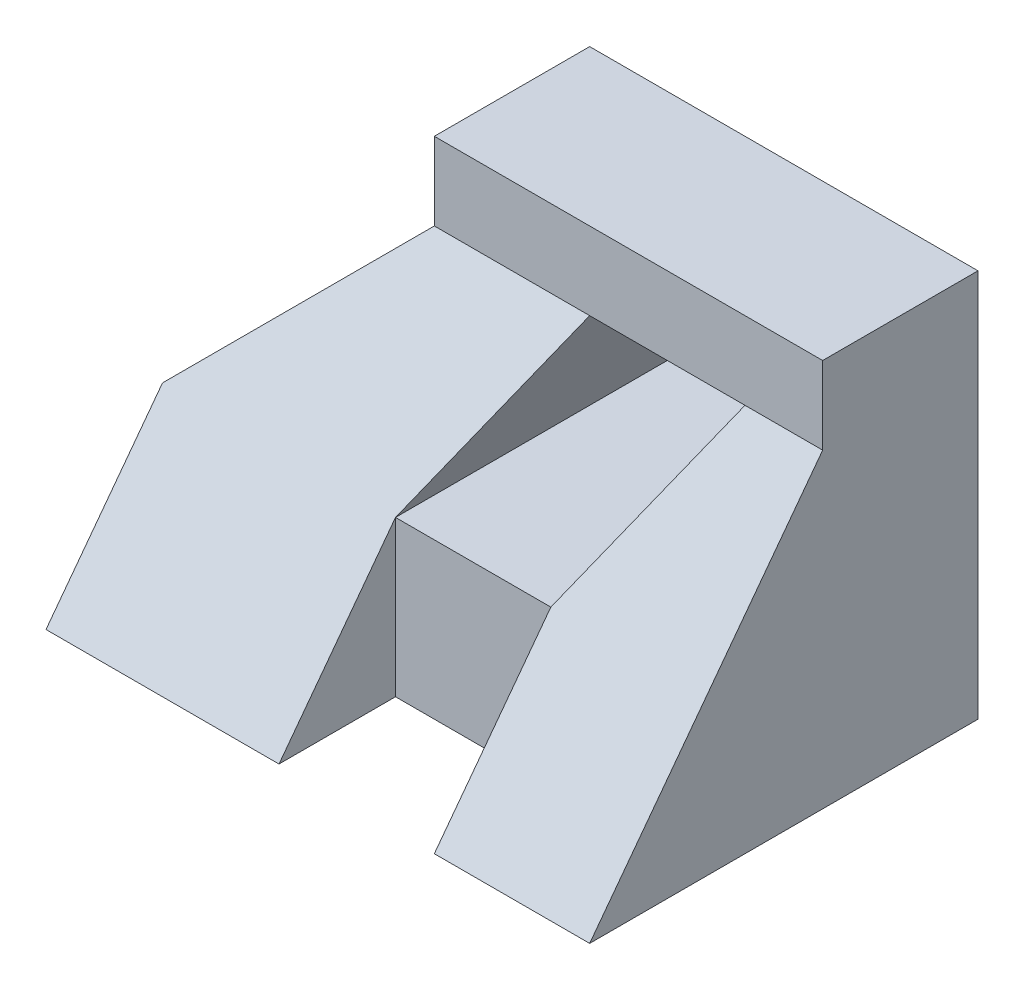
ISO-10303-21;
HEADER;
FILE_DESCRIPTION(('STEP AP214'),'2;1');
FILE_NAME('part.step','',(''),(''),'','','');
FILE_SCHEMA(('AUTOMOTIVE_DESIGN { 1 0 10303 214 1 1 1 1 }'));
ENDSEC;
DATA;
#1=APPLICATION_CONTEXT('core data for automotive mechanical design processes');
#2=APPLICATION_PROTOCOL_DEFINITION('international standard','automotive_design',2000,#1);
#3=PRODUCT_CONTEXT('',#1,'mechanical');
#4=PRODUCT('Part','Part','',(#3));
#5=PRODUCT_RELATED_PRODUCT_CATEGORY('part','',(#4));
#6=PRODUCT_DEFINITION_FORMATION('','',#4);
#7=PRODUCT_DEFINITION_CONTEXT('part definition',#1,'design');
#8=PRODUCT_DEFINITION('design','',#6,#7);
#9=PRODUCT_DEFINITION_SHAPE('','',#8);
#10=(LENGTH_UNIT() NAMED_UNIT(*) SI_UNIT(.MILLI.,.METRE.));
#11=(NAMED_UNIT(*) PLANE_ANGLE_UNIT() SI_UNIT($,.RADIAN.));
#12=(NAMED_UNIT(*) SI_UNIT($,.STERADIAN.) SOLID_ANGLE_UNIT());
#13=UNCERTAINTY_MEASURE_WITH_UNIT(LENGTH_MEASURE(1.E-05),#10,'distance_accuracy_value','');
#14=(GEOMETRIC_REPRESENTATION_CONTEXT(3) GLOBAL_UNCERTAINTY_ASSIGNED_CONTEXT((#13)) GLOBAL_UNIT_ASSIGNED_CONTEXT((#10,
#11,#12)) REPRESENTATION_CONTEXT('',''));
#15=CARTESIAN_POINT('',(0.,0.,0.));
#16=DIRECTION('',(0.,0.,1.));
#17=DIRECTION('',(1.,0.,0.));
#18=AXIS2_PLACEMENT_3D('',#15,#16,#17);
#19=CARTESIAN_POINT('',(70.,40.,50.));
#20=DIRECTION('',(-1.,0.,0.));
#21=DIRECTION('',(0.,-1.,0.));
#22=AXIS2_PLACEMENT_3D('',#19,#20,#21);
#23=PLANE('',#22);
#24=DIRECTION('',(0.,0.8,-0.6));
#25=VECTOR('',#24,1.);
#26=CARTESIAN_POINT('',(70.,24.,32.));
#27=LINE('',#26,#25);
#28=CARTESIAN_POINT('',(70.,0.,50.));
#29=VERTEX_POINT('',#28);
#30=CARTESIAN_POINT('',(70.,40.,20.));
#31=VERTEX_POINT('',#30);
#32=EDGE_CURVE('E130',#29,#31,#27,.T.);
#33=ORIENTED_EDGE('',*,*,#32,.F.);
#34=DIRECTION('',(0.,0.,-1.));
#35=VECTOR('',#34,1.);
#36=CARTESIAN_POINT('',(70.,-5.66581972714029E-13,50.));
#37=LINE('',#36,#35);
#38=CARTESIAN_POINT('',(70.,-5.66581972714029E-13,0.));
#39=VERTEX_POINT('',#38);
#40=EDGE_CURVE('E11',#29,#39,#37,.T.);
#41=ORIENTED_EDGE('',*,*,#40,.T.);
#42=DIRECTION('',(0.,1.,0.));
#43=VECTOR('',#42,1.);
#44=CARTESIAN_POINT('',(70.,40.,0.));
#45=LINE('',#44,#43);
#46=CARTESIAN_POINT('',(70.,50.,0.));
#47=VERTEX_POINT('',#46);
#48=EDGE_CURVE('E154',#39,#47,#45,.T.);
#49=ORIENTED_EDGE('',*,*,#48,.T.);
#50=DIRECTION('',(0.,0.,1.));
#51=VECTOR('',#50,1.);
#52=CARTESIAN_POINT('',(70.,50.,0.));
#53=LINE('',#52,#51);
#54=CARTESIAN_POINT('',(70.,50.,20.));
#55=VERTEX_POINT('',#54);
#56=EDGE_CURVE('E187',#47,#55,#53,.T.);
#57=ORIENTED_EDGE('',*,*,#56,.T.);
#58=DIRECTION('',(0.,1.,0.));
#59=VECTOR('',#58,1.);
#60=CARTESIAN_POINT('',(70.,50.,20.));
#61=LINE('',#60,#59);
#62=EDGE_CURVE('E142',#31,#55,#61,.T.);
#63=ORIENTED_EDGE('',*,*,#62,.F.);
#64=EDGE_LOOP('',(#33,#41,#49,#57,#63));
#65=FACE_BOUND('',#64,.T.);
#66=ADVANCED_FACE('F33',(#65),#23,.F.);
#67=CARTESIAN_POINT('',(0.,20.,50.));
#68=DIRECTION('',(0.707106781186548,-0.707106781186547,0.));
#69=DIRECTION('',(0.707106781186547,0.707106781186548,0.));
#70=AXIS2_PLACEMENT_3D('',#67,#68,#69);
#71=PLANE('',#70);
#72=DIRECTION('',(-0.624695047554424,-0.624695047554424,0.468521285665818));
#73=VECTOR('',#72,1.);
#74=CARTESIAN_POINT('',(-4.39024390243902,15.609756097561,38.2926829268293));
#75=LINE('',#74,#73);
#76=CARTESIAN_POINT('',(20.,40.,20.));
#77=VERTEX_POINT('',#76);
#78=CARTESIAN_POINT('',(0.,20.,35.));
#79=VERTEX_POINT('',#78);
#80=EDGE_CURVE('E174',#77,#79,#75,.T.);
#81=ORIENTED_EDGE('',*,*,#80,.F.);
#82=DIRECTION('',(0.,0.,-1.));
#83=VECTOR('',#82,1.);
#84=CARTESIAN_POINT('',(20.,40.,50.));
#85=LINE('',#84,#83);
#86=CARTESIAN_POINT('',(20.,40.,0.));
#87=VERTEX_POINT('',#86);
#88=EDGE_CURVE('E41',#77,#87,#85,.T.);
#89=ORIENTED_EDGE('',*,*,#88,.T.);
#90=DIRECTION('',(-0.707106781186547,-0.707106781186548,0.));
#91=VECTOR('',#90,1.);
#92=CARTESIAN_POINT('',(0.,20.,0.));
#93=LINE('',#92,#91);
#94=CARTESIAN_POINT('',(0.,20.,0.));
#95=VERTEX_POINT('',#94);
#96=EDGE_CURVE('E157',#87,#95,#93,.T.);
#97=ORIENTED_EDGE('',*,*,#96,.T.);
#98=DIRECTION('',(0.,0.,-1.));
#99=VECTOR('',#98,1.);
#100=CARTESIAN_POINT('',(0.,20.,50.));
#101=LINE('',#100,#99);
#102=EDGE_CURVE('E167',#79,#95,#101,.T.);
#103=ORIENTED_EDGE('',*,*,#102,.F.);
#104=EDGE_LOOP('',(#81,#89,#97,#103));
#105=FACE_BOUND('',#104,.T.);
#106=ADVANCED_FACE('F172',(#105),#71,.F.);
#107=CARTESIAN_POINT('',(0.,0.,50.));
#108=DIRECTION('',(1.,0.,0.));
#109=DIRECTION('',(0.,0.,-1.));
#110=AXIS2_PLACEMENT_3D('',#107,#108,#109);
#111=PLANE('',#110);
#112=DIRECTION('',(0.,0.8,-0.6));
#113=VECTOR('',#112,1.);
#114=CARTESIAN_POINT('',(0.,24.,32.));
#115=LINE('',#114,#113);
#116=CARTESIAN_POINT('',(0.,0.,50.));
#117=VERTEX_POINT('',#116);
#118=EDGE_CURVE('E144',#117,#79,#115,.T.);
#119=ORIENTED_EDGE('',*,*,#118,.T.);
#120=ORIENTED_EDGE('',*,*,#102,.T.);
#121=DIRECTION('',(0.,-1.,0.));
#122=VECTOR('',#121,1.);
#123=CARTESIAN_POINT('',(0.,0.,0.));
#124=LINE('',#123,#122);
#125=CARTESIAN_POINT('',(0.,0.,0.));
#126=VERTEX_POINT('',#125);
#127=EDGE_CURVE('E136',#95,#126,#124,.T.);
#128=ORIENTED_EDGE('',*,*,#127,.T.);
#129=DIRECTION('',(0.,0.,-1.));
#130=VECTOR('',#129,1.);
#131=CARTESIAN_POINT('',(0.,0.,50.));
#132=LINE('',#131,#130);
#133=EDGE_CURVE('E151',#117,#126,#132,.T.);
#134=ORIENTED_EDGE('',*,*,#133,.F.);
#135=EDGE_LOOP('',(#119,#120,#128,#134));
#136=FACE_BOUND('',#135,.T.);
#137=ADVANCED_FACE('F268',(#136),#111,.F.);
#138=CARTESIAN_POINT('',(50.,0.,30.));
#139=DIRECTION('',(1.,0.,0.));
#140=DIRECTION('',(0.,0.,-1.));
#141=AXIS2_PLACEMENT_3D('',#138,#139,#140);
#142=PLANE('',#141);
#143=DIRECTION('',(0.,-0.8,0.6));
#144=VECTOR('',#143,1.);
#145=CARTESIAN_POINT('',(50.,9.6,42.8));
#146=LINE('',#145,#144);
#147=CARTESIAN_POINT('',(50.,20.,35.));
#148=VERTEX_POINT('',#147);
#149=CARTESIAN_POINT('',(50.,0.,50.));
#150=VERTEX_POINT('',#149);
#151=EDGE_CURVE('E132',#148,#150,#146,.T.);
#152=ORIENTED_EDGE('',*,*,#151,.F.);
#153=DIRECTION('',(0.,1.,0.));
#154=VECTOR('',#153,1.);
#155=CARTESIAN_POINT('',(50.,20.,35.));
#156=LINE('',#155,#154);
#157=CARTESIAN_POINT('',(50.,0.,35.));
#158=VERTEX_POINT('',#157);
#159=EDGE_CURVE('E56',#158,#148,#156,.T.);
#160=ORIENTED_EDGE('',*,*,#159,.F.);
#161=DIRECTION('',(0.,0.,1.));
#162=VECTOR('',#161,1.);
#163=CARTESIAN_POINT('',(50.,0.,30.));
#164=LINE('',#163,#162);
#165=EDGE_CURVE('E155',#158,#150,#164,.T.);
#166=ORIENTED_EDGE('',*,*,#165,.T.);
#167=EDGE_LOOP('',(#152,#160,#166));
#168=FACE_BOUND('',#167,.T.);
#169=ADVANCED_FACE('F273',(#168),#142,.F.);
#170=CARTESIAN_POINT('',(30.,0.,30.));
#171=DIRECTION('',(-1.,0.,0.));
#172=DIRECTION('',(0.,0.,1.));
#173=AXIS2_PLACEMENT_3D('',#170,#171,#172);
#174=PLANE('',#173);
#175=DIRECTION('',(0.,0.8,-0.6));
#176=VECTOR('',#175,1.);
#177=CARTESIAN_POINT('',(30.,9.6,42.8));
#178=LINE('',#177,#176);
#179=CARTESIAN_POINT('',(30.,0.,50.));
#180=VERTEX_POINT('',#179);
#181=CARTESIAN_POINT('',(30.,20.,35.));
#182=VERTEX_POINT('',#181);
#183=EDGE_CURVE('E206',#180,#182,#178,.T.);
#184=ORIENTED_EDGE('',*,*,#183,.F.);
#185=DIRECTION('',(0.,0.,1.));
#186=VECTOR('',#185,1.);
#187=CARTESIAN_POINT('',(30.,0.,30.));
#188=LINE('',#187,#186);
#189=CARTESIAN_POINT('',(30.,0.,35.));
#190=VERTEX_POINT('',#189);
#191=EDGE_CURVE('E159',#190,#180,#188,.T.);
#192=ORIENTED_EDGE('',*,*,#191,.F.);
#193=DIRECTION('',(0.,-1.,0.));
#194=VECTOR('',#193,1.);
#195=CARTESIAN_POINT('',(30.,20.,35.));
#196=LINE('',#195,#194);
#197=EDGE_CURVE('E204',#182,#190,#196,.T.);
#198=ORIENTED_EDGE('',*,*,#197,.F.);
#199=EDGE_LOOP('',(#184,#192,#198));
#200=FACE_BOUND('',#199,.T.);
#201=ADVANCED_FACE('F203',(#200),#174,.F.);
#202=CARTESIAN_POINT('',(30.,20.,40.));
#203=DIRECTION('',(-0.894427190999916,0.447213595499959,0.));
#204=DIRECTION('',(-0.447213595499959,-0.894427190999916,0.));
#205=AXIS2_PLACEMENT_3D('',#202,#203,#204);
#206=PLANE('',#205);
#207=DIRECTION('',(0.371390676354104,0.742781352708207,-0.557086014531155));
#208=VECTOR('',#207,1.);
#209=CARTESIAN_POINT('',(28.9655172413793,17.9310344827586,36.551724137931));
#210=LINE('',#209,#208);
#211=CARTESIAN_POINT('',(40.,40.,20.));
#212=VERTEX_POINT('',#211);
#213=EDGE_CURVE('E209',#182,#212,#210,.T.);
#214=ORIENTED_EDGE('',*,*,#213,.F.);
#215=DIRECTION('',(0.,0.,1.));
#216=VECTOR('',#215,1.);
#217=CARTESIAN_POINT('',(30.,20.,0.));
#218=LINE('',#217,#216);
#219=CARTESIAN_POINT('',(30.,20.,0.));
#220=VERTEX_POINT('',#219);
#221=EDGE_CURVE('E226',#220,#182,#218,.T.);
#222=ORIENTED_EDGE('',*,*,#221,.F.);
#223=DIRECTION('',(-0.447213595499959,-0.894427190999916,0.));
#224=VECTOR('',#223,1.);
#225=CARTESIAN_POINT('',(30.,20.,0.));
#226=LINE('',#225,#224);
#227=CARTESIAN_POINT('',(40.,40.,0.));
#228=VERTEX_POINT('',#227);
#229=EDGE_CURVE('E216',#228,#220,#226,.T.);
#230=ORIENTED_EDGE('',*,*,#229,.F.);
#231=DIRECTION('',(0.,0.,1.));
#232=VECTOR('',#231,1.);
#233=CARTESIAN_POINT('',(40.,40.,0.));
#234=LINE('',#233,#232);
#235=EDGE_CURVE('E227',#228,#212,#234,.T.);
#236=ORIENTED_EDGE('',*,*,#235,.T.);
#237=EDGE_LOOP('',(#214,#222,#230,#236));
#238=FACE_BOUND('',#237,.T.);
#239=ADVANCED_FACE('F282',(#238),#206,.F.);
#240=CARTESIAN_POINT('',(50.,20.,40.));
#241=DIRECTION('',(0.894427190999916,-0.447213595499958,0.));
#242=DIRECTION('',(0.447213595499958,0.894427190999916,0.));
#243=AXIS2_PLACEMENT_3D('',#240,#241,#242);
#244=PLANE('',#243);
#245=DIRECTION('',(-0.371390676354104,-0.742781352708207,0.557086014531155));
#246=VECTOR('',#245,1.);
#247=CARTESIAN_POINT('',(48.9655172413793,17.9310344827586,36.551724137931));
#248=LINE('',#247,#246);
#249=CARTESIAN_POINT('',(60.,40.,20.));
#250=VERTEX_POINT('',#249);
#251=EDGE_CURVE('E143',#250,#148,#248,.T.);
#252=ORIENTED_EDGE('',*,*,#251,.F.);
#253=DIRECTION('',(0.,0.,1.));
#254=VECTOR('',#253,1.);
#255=CARTESIAN_POINT('',(60.,40.,0.));
#256=LINE('',#255,#254);
#257=CARTESIAN_POINT('',(60.,40.,0.));
#258=VERTEX_POINT('',#257);
#259=EDGE_CURVE('E230',#258,#250,#256,.T.);
#260=ORIENTED_EDGE('',*,*,#259,.F.);
#261=DIRECTION('',(0.447213595499959,0.894427190999916,0.));
#262=VECTOR('',#261,1.);
#263=CARTESIAN_POINT('',(60.,40.,0.));
#264=LINE('',#263,#262);
#265=CARTESIAN_POINT('',(50.,20.,0.));
#266=VERTEX_POINT('',#265);
#267=EDGE_CURVE('E48',#266,#258,#264,.T.);
#268=ORIENTED_EDGE('',*,*,#267,.F.);
#269=DIRECTION('',(0.,0.,1.));
#270=VECTOR('',#269,1.);
#271=CARTESIAN_POINT('',(50.,20.,0.));
#272=LINE('',#271,#270);
#273=EDGE_CURVE('E233',#266,#148,#272,.T.);
#274=ORIENTED_EDGE('',*,*,#273,.T.);
#275=EDGE_LOOP('',(#252,#260,#268,#274));
#276=FACE_BOUND('',#275,.T.);
#277=ADVANCED_FACE('F261',(#276),#244,.F.);
#278=CARTESIAN_POINT('',(20.,40.,0.));
#279=DIRECTION('',(-1.,0.,0.));
#280=DIRECTION('',(0.,0.,1.));
#281=AXIS2_PLACEMENT_3D('',#278,#279,#280);
#282=PLANE('',#281);
#283=ORIENTED_EDGE('',*,*,#88,.F.);
#284=DIRECTION('',(0.,-1.,0.));
#285=VECTOR('',#284,1.);
#286=CARTESIAN_POINT('',(20.,50.,20.));
#287=LINE('',#286,#285);
#288=CARTESIAN_POINT('',(20.,50.,20.));
#289=VERTEX_POINT('',#288);
#290=EDGE_CURVE('E242',#289,#77,#287,.T.);
#291=ORIENTED_EDGE('',*,*,#290,.F.);
#292=DIRECTION('',(0.,0.,1.));
#293=VECTOR('',#292,1.);
#294=CARTESIAN_POINT('',(20.,50.,0.));
#295=LINE('',#294,#293);
#296=CARTESIAN_POINT('',(20.,50.,0.));
#297=VERTEX_POINT('',#296);
#298=EDGE_CURVE('E186',#297,#289,#295,.T.);
#299=ORIENTED_EDGE('',*,*,#298,.F.);
#300=DIRECTION('',(0.,-1.,0.));
#301=VECTOR('',#300,1.);
#302=CARTESIAN_POINT('',(20.,40.,0.));
#303=LINE('',#302,#301);
#304=EDGE_CURVE('E182',#297,#87,#303,.T.);
#305=ORIENTED_EDGE('',*,*,#304,.T.);
#306=EDGE_LOOP('',(#283,#291,#299,#305));
#307=FACE_BOUND('',#306,.T.);
#308=ADVANCED_FACE('F184',(#307),#282,.T.);
#309=CARTESIAN_POINT('',(70.,50.,0.));
#310=DIRECTION('',(0.,1.,0.));
#311=DIRECTION('',(-1.,0.,0.));
#312=AXIS2_PLACEMENT_3D('',#309,#310,#311);
#313=PLANE('',#312);
#314=ORIENTED_EDGE('',*,*,#298,.T.);
#315=DIRECTION('',(-1.,0.,0.));
#316=VECTOR('',#315,1.);
#317=CARTESIAN_POINT('',(20.,50.,20.));
#318=LINE('',#317,#316);
#319=EDGE_CURVE('E191',#55,#289,#318,.T.);
#320=ORIENTED_EDGE('',*,*,#319,.F.);
#321=ORIENTED_EDGE('',*,*,#56,.F.);
#322=DIRECTION('',(-1.,0.,0.));
#323=VECTOR('',#322,1.);
#324=CARTESIAN_POINT('',(70.,50.,0.));
#325=LINE('',#324,#323);
#326=EDGE_CURVE('E188',#47,#297,#325,.T.);
#327=ORIENTED_EDGE('',*,*,#326,.T.);
#328=EDGE_LOOP('',(#314,#320,#321,#327));
#329=FACE_BOUND('',#328,.T.);
#330=ADVANCED_FACE('F254',(#329),#313,.T.);
#331=CARTESIAN_POINT('',(70.,-5.66581972714029E-13,50.));
#332=DIRECTION('',(0.,1.,0.));
#333=DIRECTION('',(-1.,0.,0.));
#334=AXIS2_PLACEMENT_3D('',#331,#332,#333);
#335=PLANE('',#334);
#336=ORIENTED_EDGE('',*,*,#165,.F.);
#337=DIRECTION('',(1.,0.,0.));
#338=VECTOR('',#337,1.);
#339=CARTESIAN_POINT('',(30.,0.,35.));
#340=LINE('',#339,#338);
#341=EDGE_CURVE('E198',#190,#158,#340,.T.);
#342=ORIENTED_EDGE('',*,*,#341,.F.);
#343=ORIENTED_EDGE('',*,*,#191,.T.);
#344=DIRECTION('',(1.,0.,0.));
#345=VECTOR('',#344,1.);
#346=CARTESIAN_POINT('',(70.,-5.66581972714029E-13,50.));
#347=LINE('',#346,#345);
#348=EDGE_CURVE('E135',#117,#180,#347,.T.);
#349=ORIENTED_EDGE('',*,*,#348,.F.);
#350=ORIENTED_EDGE('',*,*,#133,.T.);
#351=DIRECTION('',(1.,0.,0.));
#352=VECTOR('',#351,1.);
#353=CARTESIAN_POINT('',(70.,-5.66581972714029E-13,0.));
#354=LINE('',#353,#352);
#355=EDGE_CURVE('E148',#126,#39,#354,.T.);
#356=ORIENTED_EDGE('',*,*,#355,.T.);
#357=ORIENTED_EDGE('',*,*,#40,.F.);
#358=EDGE_CURVE('E127',#150,#29,#347,.T.);
#359=ORIENTED_EDGE('',*,*,#358,.F.);
#360=EDGE_LOOP('',(#336,#342,#343,#349,#350,#356,#357,#359));
#361=FACE_BOUND('',#360,.T.);
#362=ADVANCED_FACE('F35',(#361),#335,.F.);
#363=CARTESIAN_POINT('',(0.,0.,0.));
#364=DIRECTION('',(0.,0.,-1.));
#365=DIRECTION('',(-1.,0.,0.));
#366=AXIS2_PLACEMENT_3D('',#363,#364,#365);
#367=PLANE('',#366);
#368=ORIENTED_EDGE('',*,*,#229,.T.);
#369=DIRECTION('',(1.,0.,0.));
#370=VECTOR('',#369,1.);
#371=CARTESIAN_POINT('',(50.,20.,0.));
#372=LINE('',#371,#370);
#373=EDGE_CURVE('E219',#220,#266,#372,.T.);
#374=ORIENTED_EDGE('',*,*,#373,.T.);
#375=ORIENTED_EDGE('',*,*,#267,.T.);
#376=DIRECTION('',(-1.,0.,0.));
#377=VECTOR('',#376,1.);
#378=CARTESIAN_POINT('',(40.,40.,0.));
#379=LINE('',#378,#377);
#380=EDGE_CURVE('E223',#258,#228,#379,.T.);
#381=ORIENTED_EDGE('',*,*,#380,.T.);
#382=EDGE_LOOP('',(#368,#374,#375,#381));
#383=FACE_BOUND('',#382,.T.);
#384=ORIENTED_EDGE('',*,*,#355,.F.);
#385=ORIENTED_EDGE('',*,*,#127,.F.);
#386=ORIENTED_EDGE('',*,*,#96,.F.);
#387=ORIENTED_EDGE('',*,*,#304,.F.);
#388=ORIENTED_EDGE('',*,*,#326,.F.);
#389=ORIENTED_EDGE('',*,*,#48,.F.);
#390=EDGE_LOOP('',(#384,#385,#386,#387,#388,#389));
#391=FACE_BOUND('',#390,.T.);
#392=ADVANCED_FACE('F180',(#383,#391),#367,.T.);
#393=CARTESIAN_POINT('',(0.,0.,20.));
#394=DIRECTION('',(0.,0.,1.));
#395=DIRECTION('',(1.,0.,0.));
#396=AXIS2_PLACEMENT_3D('',#393,#394,#395);
#397=PLANE('',#396);
#398=ORIENTED_EDGE('',*,*,#290,.T.);
#399=DIRECTION('',(1.,0.,0.));
#400=VECTOR('',#399,1.);
#401=CARTESIAN_POINT('',(20.,40.,20.));
#402=LINE('',#401,#400);
#403=EDGE_CURVE('E245',#77,#212,#402,.T.);
#404=ORIENTED_EDGE('',*,*,#403,.T.);
#405=EDGE_CURVE('E248',#212,#250,#402,.T.);
#406=ORIENTED_EDGE('',*,*,#405,.T.);
#407=EDGE_CURVE('E244',#250,#31,#402,.T.);
#408=ORIENTED_EDGE('',*,*,#407,.T.);
#409=ORIENTED_EDGE('',*,*,#62,.T.);
#410=ORIENTED_EDGE('',*,*,#319,.T.);
#411=EDGE_LOOP('',(#398,#404,#406,#408,#409,#410));
#412=FACE_BOUND('',#411,.T.);
#413=ADVANCED_FACE('F251',(#412),#397,.T.);
#414=CARTESIAN_POINT('',(0.,0.,35.));
#415=DIRECTION('',(0.,0.,1.));
#416=DIRECTION('',(1.,0.,0.));
#417=AXIS2_PLACEMENT_3D('',#414,#415,#416);
#418=PLANE('',#417);
#419=ORIENTED_EDGE('',*,*,#197,.T.);
#420=ORIENTED_EDGE('',*,*,#341,.T.);
#421=ORIENTED_EDGE('',*,*,#159,.T.);
#422=DIRECTION('',(-1.,0.,0.));
#423=VECTOR('',#422,1.);
#424=CARTESIAN_POINT('',(30.,20.,35.));
#425=LINE('',#424,#423);
#426=EDGE_CURVE('E240',#148,#182,#425,.T.);
#427=ORIENTED_EDGE('',*,*,#426,.T.);
#428=EDGE_LOOP('',(#419,#420,#421,#427));
#429=FACE_BOUND('',#428,.T.);
#430=ADVANCED_FACE('F310',(#429),#418,.T.);
#431=CARTESIAN_POINT('',(40.,40.,0.));
#432=DIRECTION('',(0.,1.,0.));
#433=DIRECTION('',(-1.,0.,0.));
#434=AXIS2_PLACEMENT_3D('',#431,#432,#433);
#435=PLANE('',#434);
#436=ORIENTED_EDGE('',*,*,#405,.F.);
#437=ORIENTED_EDGE('',*,*,#235,.F.);
#438=ORIENTED_EDGE('',*,*,#380,.F.);
#439=ORIENTED_EDGE('',*,*,#259,.T.);
#440=EDGE_LOOP('',(#436,#437,#438,#439));
#441=FACE_BOUND('',#440,.T.);
#442=ADVANCED_FACE('F296',(#441),#435,.F.);
#443=CARTESIAN_POINT('',(50.,20.,0.));
#444=DIRECTION('',(0.,-1.,0.));
#445=DIRECTION('',(0.,0.,-1.));
#446=AXIS2_PLACEMENT_3D('',#443,#444,#445);
#447=PLANE('',#446);
#448=ORIENTED_EDGE('',*,*,#426,.F.);
#449=ORIENTED_EDGE('',*,*,#273,.F.);
#450=ORIENTED_EDGE('',*,*,#373,.F.);
#451=ORIENTED_EDGE('',*,*,#221,.T.);
#452=EDGE_LOOP('',(#448,#449,#450,#451));
#453=FACE_BOUND('',#452,.T.);
#454=ADVANCED_FACE('F293',(#453),#447,.F.);
#455=CARTESIAN_POINT('',(70.,24.,32.));
#456=DIRECTION('',(0.,0.6,0.8));
#457=DIRECTION('',(0.,-0.8,0.6));
#458=AXIS2_PLACEMENT_3D('',#455,#456,#457);
#459=PLANE('',#458);
#460=ORIENTED_EDGE('',*,*,#151,.T.);
#461=ORIENTED_EDGE('',*,*,#358,.T.);
#462=ORIENTED_EDGE('',*,*,#32,.T.);
#463=ORIENTED_EDGE('',*,*,#407,.F.);
#464=ORIENTED_EDGE('',*,*,#251,.T.);
#465=EDGE_LOOP('',(#460,#461,#462,#463,#464));
#466=FACE_BOUND('',#465,.T.);
#467=ADVANCED_FACE('F129',(#466),#459,.T.);
#468=ORIENTED_EDGE('',*,*,#80,.T.);
#469=ORIENTED_EDGE('',*,*,#118,.F.);
#470=ORIENTED_EDGE('',*,*,#348,.T.);
#471=ORIENTED_EDGE('',*,*,#183,.T.);
#472=ORIENTED_EDGE('',*,*,#213,.T.);
#473=ORIENTED_EDGE('',*,*,#403,.F.);
#474=EDGE_LOOP('',(#468,#469,#470,#471,#472,#473));
#475=FACE_BOUND('',#474,.T.);
#476=ADVANCED_FACE('F301',(#475),#459,.T.);
#477=CLOSED_SHELL('',(#66,#106,#137,#169,#201,#239,#277,#308,#330,#362,#392,#413,#430,#442,#454,
#467,#476));
#478=MANIFOLD_SOLID_BREP('B2',#477);
#479=ADVANCED_BREP_SHAPE_REPRESENTATION('',(#18,#478),#14);
#480=SHAPE_DEFINITION_REPRESENTATION(#9,#479);
ENDSEC;
END-ISO-10303-21;
